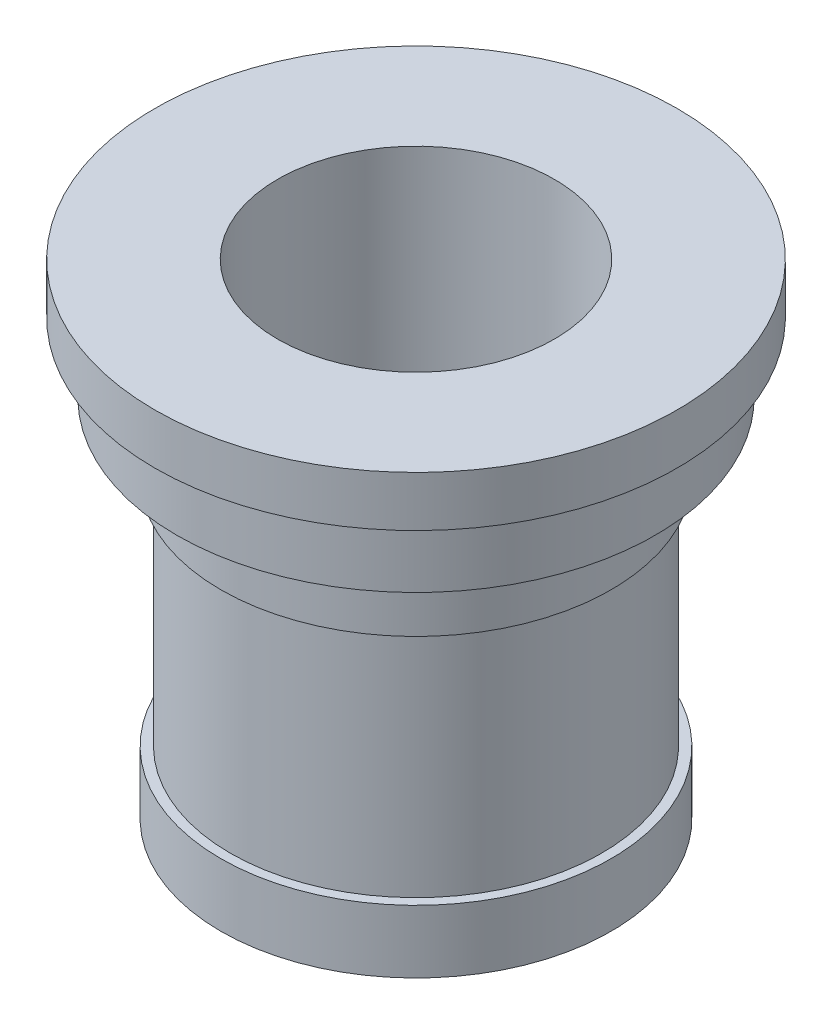
ISO-10303-21;
HEADER;
FILE_DESCRIPTION(('STEP AP214'),'2;1');
FILE_NAME('part.step','',(''),(''),'','','');
FILE_SCHEMA(('AUTOMOTIVE_DESIGN { 1 0 10303 214 1 1 1 1 }'));
ENDSEC;
DATA;
#1=APPLICATION_CONTEXT('core data for automotive mechanical design processes');
#2=APPLICATION_PROTOCOL_DEFINITION('international standard','automotive_design',2000,#1);
#3=PRODUCT_CONTEXT('',#1,'mechanical');
#4=PRODUCT('Part','Part','',(#3));
#5=PRODUCT_RELATED_PRODUCT_CATEGORY('part','',(#4));
#6=PRODUCT_DEFINITION_FORMATION('','',#4);
#7=PRODUCT_DEFINITION_CONTEXT('part definition',#1,'design');
#8=PRODUCT_DEFINITION('design','',#6,#7);
#9=PRODUCT_DEFINITION_SHAPE('','',#8);
#10=(LENGTH_UNIT() NAMED_UNIT(*) SI_UNIT(.MILLI.,.METRE.));
#11=(NAMED_UNIT(*) PLANE_ANGLE_UNIT() SI_UNIT($,.RADIAN.));
#12=(NAMED_UNIT(*) SI_UNIT($,.STERADIAN.) SOLID_ANGLE_UNIT());
#13=UNCERTAINTY_MEASURE_WITH_UNIT(LENGTH_MEASURE(1.E-05),#10,'distance_accuracy_value','');
#14=(GEOMETRIC_REPRESENTATION_CONTEXT(3) GLOBAL_UNCERTAINTY_ASSIGNED_CONTEXT((#13)) GLOBAL_UNIT_ASSIGNED_CONTEXT((#10,
#11,#12)) REPRESENTATION_CONTEXT('',''));
#15=CARTESIAN_POINT('',(0.,0.,0.));
#16=DIRECTION('',(0.,0.,1.));
#17=DIRECTION('',(1.,0.,0.));
#18=AXIS2_PLACEMENT_3D('',#15,#16,#17);
#19=CARTESIAN_POINT('',(31.,0.,0.));
#20=DIRECTION('',(0.,1.,0.));
#21=DIRECTION('',(0.,0.,1.));
#22=AXIS2_PLACEMENT_3D('',#19,#20,#21);
#23=PLANE('',#22);
#24=CARTESIAN_POINT('',(0.,0.,0.));
#25=DIRECTION('',(0.,1.,0.));
#26=DIRECTION('',(0.,0.,1.));
#27=AXIS2_PLACEMENT_3D('',#24,#25,#26);
#28=CIRCLE('',#27,31.);
#29=CARTESIAN_POINT('',(0.,0.,31.));
#30=VERTEX_POINT('',#29);
#31=EDGE_CURVE('E102',#30,#30,#28,.T.);
#32=ORIENTED_EDGE('',*,*,#31,.F.);
#33=EDGE_LOOP('',(#32));
#34=FACE_BOUND('',#33,.T.);
#35=CARTESIAN_POINT('',(0.,0.,0.));
#36=DIRECTION('',(0.,1.,0.));
#37=DIRECTION('',(0.,0.,1.));
#38=AXIS2_PLACEMENT_3D('',#35,#36,#37);
#39=CIRCLE('',#38,22.);
#40=CARTESIAN_POINT('',(-21.9488636363636,0.,1.49912810403716));
#41=VERTEX_POINT('',#40);
#42=CARTESIAN_POINT('',(-21.9488636363636,0.,-1.49912810403716));
#43=VERTEX_POINT('',#42);
#44=EDGE_CURVE('E68',#41,#43,#39,.T.);
#45=ORIENTED_EDGE('',*,*,#44,.T.);
#46=CARTESIAN_POINT('',(-22.,0.,0.));
#47=DIRECTION('',(0.,-1.,0.));
#48=DIRECTION('',(0.,0.,-1.));
#49=AXIS2_PLACEMENT_3D('',#46,#47,#48);
#50=CIRCLE('',#49,1.5);
#51=EDGE_CURVE('E58',#41,#43,#50,.T.);
#52=ORIENTED_EDGE('',*,*,#51,.F.);
#53=EDGE_LOOP('',(#45,#52));
#54=FACE_BOUND('',#53,.T.);
#55=ADVANCED_FACE('F33',(#34,#54),#23,.F.);
#56=CARTESIAN_POINT('',(0.,42.013888888889,0.));
#57=DIRECTION('',(0.,1.,0.));
#58=DIRECTION('',(0.,0.,1.));
#59=AXIS2_PLACEMENT_3D('',#56,#57,#58);
#60=CYLINDRICAL_SURFACE('',#59,22.);
#61=ORIENTED_EDGE('',*,*,#44,.F.);
#62=DIRECTION('',(0.,-1.,0.));
#63=VECTOR('',#62,1.);
#64=CARTESIAN_POINT('',(-21.9488636363636,2.5,1.49912810403716));
#65=LINE('',#64,#63);
#66=CARTESIAN_POINT('',(-21.9488636363636,5.,1.49912810403716));
#67=VERTEX_POINT('',#66);
#68=EDGE_CURVE('E11',#41,#67,#65,.F.);
#69=ORIENTED_EDGE('',*,*,#68,.T.);
#70=CARTESIAN_POINT('',(0.,5.,0.));
#71=DIRECTION('',(0.,-1.,0.));
#72=DIRECTION('',(0.,0.,-1.));
#73=AXIS2_PLACEMENT_3D('',#70,#71,#72);
#74=CIRCLE('',#73,22.);
#75=CARTESIAN_POINT('',(-21.9488636363636,5.,-1.49912810403716));
#76=VERTEX_POINT('',#75);
#77=EDGE_CURVE('E50',#76,#67,#74,.F.);
#78=ORIENTED_EDGE('',*,*,#77,.F.);
#79=DIRECTION('',(0.,-1.,0.));
#80=VECTOR('',#79,1.);
#81=CARTESIAN_POINT('',(-21.9488636363636,2.5,-1.49912810403716));
#82=LINE('',#81,#80);
#83=EDGE_CURVE('E40',#76,#43,#82,.T.);
#84=ORIENTED_EDGE('',*,*,#83,.T.);
#85=EDGE_LOOP('',(#61,#69,#78,#84));
#86=FACE_BOUND('',#85,.T.);
#87=CARTESIAN_POINT('',(0.,77.,0.));
#88=DIRECTION('',(0.,1.,0.));
#89=DIRECTION('',(0.,0.,1.));
#90=AXIS2_PLACEMENT_3D('',#87,#88,#89);
#91=CIRCLE('',#90,22.);
#92=CARTESIAN_POINT('',(0.,77.,22.));
#93=VERTEX_POINT('',#92);
#94=EDGE_CURVE('E69',#93,#93,#91,.T.);
#95=ORIENTED_EDGE('',*,*,#94,.T.);
#96=EDGE_LOOP('',(#95));
#97=FACE_BOUND('',#96,.T.);
#98=ADVANCED_FACE('F66',(#86,#97),#60,.F.);
#99=CARTESIAN_POINT('',(22.,77.,0.));
#100=DIRECTION('',(0.,-1.,0.));
#101=DIRECTION('',(0.,0.,-1.));
#102=AXIS2_PLACEMENT_3D('',#99,#100,#101);
#103=PLANE('',#102);
#104=ORIENTED_EDGE('',*,*,#94,.F.);
#105=EDGE_LOOP('',(#104));
#106=FACE_BOUND('',#105,.T.);
#107=CARTESIAN_POINT('',(0.,77.,0.));
#108=DIRECTION('',(0.,1.,0.));
#109=DIRECTION('',(0.,0.,1.));
#110=AXIS2_PLACEMENT_3D('',#107,#108,#109);
#111=CIRCLE('',#110,41.5);
#112=CARTESIAN_POINT('',(0.,77.,41.5));
#113=VERTEX_POINT('',#112);
#114=EDGE_CURVE('E73',#113,#113,#111,.T.);
#115=ORIENTED_EDGE('',*,*,#114,.T.);
#116=EDGE_LOOP('',(#115));
#117=FACE_BOUND('',#116,.T.);
#118=ADVANCED_FACE('F113',(#106,#117),#103,.F.);
#119=CARTESIAN_POINT('',(0.,42.013888888889,0.));
#120=DIRECTION('',(0.,1.,0.));
#121=DIRECTION('',(0.,0.,1.));
#122=AXIS2_PLACEMENT_3D('',#119,#120,#121);
#123=CYLINDRICAL_SURFACE('',#122,41.5);
#124=ORIENTED_EDGE('',*,*,#114,.F.);
#125=EDGE_LOOP('',(#124));
#126=FACE_BOUND('',#125,.T.);
#127=CARTESIAN_POINT('',(0.,69.,0.));
#128=DIRECTION('',(0.,1.,0.));
#129=DIRECTION('',(0.,0.,1.));
#130=AXIS2_PLACEMENT_3D('',#127,#128,#129);
#131=CIRCLE('',#130,41.5);
#132=CARTESIAN_POINT('',(0.,69.,41.5));
#133=VERTEX_POINT('',#132);
#134=EDGE_CURVE('E78',#133,#133,#131,.T.);
#135=ORIENTED_EDGE('',*,*,#134,.T.);
#136=EDGE_LOOP('',(#135));
#137=FACE_BOUND('',#136,.T.);
#138=ADVANCED_FACE('F117',(#126,#137),#123,.T.);
#139=CARTESIAN_POINT('',(41.5,69.,0.));
#140=DIRECTION('',(0.,1.,0.));
#141=DIRECTION('',(0.,0.,1.));
#142=AXIS2_PLACEMENT_3D('',#139,#140,#141);
#143=PLANE('',#142);
#144=ORIENTED_EDGE('',*,*,#134,.F.);
#145=EDGE_LOOP('',(#144));
#146=FACE_BOUND('',#145,.T.);
#147=CARTESIAN_POINT('',(0.,69.,0.));
#148=DIRECTION('',(0.,1.,0.));
#149=DIRECTION('',(0.,0.,1.));
#150=AXIS2_PLACEMENT_3D('',#147,#148,#149);
#151=CIRCLE('',#150,38.);
#152=CARTESIAN_POINT('',(0.,69.,38.));
#153=VERTEX_POINT('',#152);
#154=EDGE_CURVE('E81',#153,#153,#151,.T.);
#155=ORIENTED_EDGE('',*,*,#154,.T.);
#156=EDGE_LOOP('',(#155));
#157=FACE_BOUND('',#156,.T.);
#158=ADVANCED_FACE('F123',(#146,#157),#143,.F.);
#159=CARTESIAN_POINT('',(0.,42.013888888889,0.));
#160=DIRECTION('',(0.,1.,0.));
#161=DIRECTION('',(0.,0.,1.));
#162=AXIS2_PLACEMENT_3D('',#159,#160,#161);
#163=CYLINDRICAL_SURFACE('',#162,38.);
#164=ORIENTED_EDGE('',*,*,#154,.F.);
#165=EDGE_LOOP('',(#164));
#166=FACE_BOUND('',#165,.T.);
#167=CARTESIAN_POINT('',(0.,58.,0.));
#168=DIRECTION('',(0.,1.,0.));
#169=DIRECTION('',(0.,0.,1.));
#170=AXIS2_PLACEMENT_3D('',#167,#168,#169);
#171=CIRCLE('',#170,38.);
#172=CARTESIAN_POINT('',(0.,58.,38.));
#173=VERTEX_POINT('',#172);
#174=EDGE_CURVE('E84',#173,#173,#171,.T.);
#175=ORIENTED_EDGE('',*,*,#174,.T.);
#176=EDGE_LOOP('',(#175));
#177=FACE_BOUND('',#176,.T.);
#178=ADVANCED_FACE('F127',(#166,#177),#163,.T.);
#179=CARTESIAN_POINT('',(38.,58.,0.));
#180=DIRECTION('',(0.,1.,0.));
#181=DIRECTION('',(0.,0.,1.));
#182=AXIS2_PLACEMENT_3D('',#179,#180,#181);
#183=PLANE('',#182);
#184=ORIENTED_EDGE('',*,*,#174,.F.);
#185=EDGE_LOOP('',(#184));
#186=FACE_BOUND('',#185,.T.);
#187=CARTESIAN_POINT('',(0.,58.,0.));
#188=DIRECTION('',(0.,1.,0.));
#189=DIRECTION('',(0.,0.,1.));
#190=AXIS2_PLACEMENT_3D('',#187,#188,#189);
#191=CIRCLE('',#190,31.);
#192=CARTESIAN_POINT('',(0.,58.,31.));
#193=VERTEX_POINT('',#192);
#194=EDGE_CURVE('E87',#193,#193,#191,.T.);
#195=ORIENTED_EDGE('',*,*,#194,.T.);
#196=EDGE_LOOP('',(#195));
#197=FACE_BOUND('',#196,.T.);
#198=ADVANCED_FACE('F131',(#186,#197),#183,.F.);
#199=CARTESIAN_POINT('',(0.,42.013888888889,0.));
#200=DIRECTION('',(0.,1.,0.));
#201=DIRECTION('',(0.,0.,1.));
#202=AXIS2_PLACEMENT_3D('',#199,#200,#201);
#203=CYLINDRICAL_SURFACE('',#202,31.);
#204=ORIENTED_EDGE('',*,*,#194,.F.);
#205=EDGE_LOOP('',(#204));
#206=FACE_BOUND('',#205,.T.);
#207=CARTESIAN_POINT('',(0.,47.,0.));
#208=DIRECTION('',(0.,1.,0.));
#209=DIRECTION('',(0.,0.,1.));
#210=AXIS2_PLACEMENT_3D('',#207,#208,#209);
#211=CIRCLE('',#210,31.);
#212=CARTESIAN_POINT('',(0.,47.,31.));
#213=VERTEX_POINT('',#212);
#214=EDGE_CURVE('E90',#213,#213,#211,.T.);
#215=ORIENTED_EDGE('',*,*,#214,.T.);
#216=EDGE_LOOP('',(#215));
#217=FACE_BOUND('',#216,.T.);
#218=ADVANCED_FACE('F135',(#206,#217),#203,.T.);
#219=CARTESIAN_POINT('',(31.,47.,0.));
#220=DIRECTION('',(0.,1.,0.));
#221=DIRECTION('',(0.,0.,1.));
#222=AXIS2_PLACEMENT_3D('',#219,#220,#221);
#223=PLANE('',#222);
#224=ORIENTED_EDGE('',*,*,#214,.F.);
#225=EDGE_LOOP('',(#224));
#226=FACE_BOUND('',#225,.T.);
#227=CARTESIAN_POINT('',(0.,47.,0.));
#228=DIRECTION('',(0.,1.,0.));
#229=DIRECTION('',(0.,0.,1.));
#230=AXIS2_PLACEMENT_3D('',#227,#228,#229);
#231=CIRCLE('',#230,29.5);
#232=CARTESIAN_POINT('',(0.,47.,29.5));
#233=VERTEX_POINT('',#232);
#234=EDGE_CURVE('E93',#233,#233,#231,.T.);
#235=ORIENTED_EDGE('',*,*,#234,.T.);
#236=EDGE_LOOP('',(#235));
#237=FACE_BOUND('',#236,.T.);
#238=ADVANCED_FACE('F139',(#226,#237),#223,.F.);
#239=CARTESIAN_POINT('',(0.,42.013888888889,0.));
#240=DIRECTION('',(0.,1.,0.));
#241=DIRECTION('',(0.,0.,1.));
#242=AXIS2_PLACEMENT_3D('',#239,#240,#241);
#243=CYLINDRICAL_SURFACE('',#242,29.5);
#244=ORIENTED_EDGE('',*,*,#234,.F.);
#245=EDGE_LOOP('',(#244));
#246=FACE_BOUND('',#245,.T.);
#247=CARTESIAN_POINT('',(0.,10.,0.));
#248=DIRECTION('',(0.,1.,0.));
#249=DIRECTION('',(0.,0.,1.));
#250=AXIS2_PLACEMENT_3D('',#247,#248,#249);
#251=CIRCLE('',#250,29.5);
#252=CARTESIAN_POINT('',(0.,10.,29.5));
#253=VERTEX_POINT('',#252);
#254=EDGE_CURVE('E96',#253,#253,#251,.T.);
#255=ORIENTED_EDGE('',*,*,#254,.T.);
#256=EDGE_LOOP('',(#255));
#257=FACE_BOUND('',#256,.T.);
#258=ADVANCED_FACE('F143',(#246,#257),#243,.T.);
#259=CARTESIAN_POINT('',(29.5,10.,0.));
#260=DIRECTION('',(0.,-1.,0.));
#261=DIRECTION('',(0.,0.,-1.));
#262=AXIS2_PLACEMENT_3D('',#259,#260,#261);
#263=PLANE('',#262);
#264=ORIENTED_EDGE('',*,*,#254,.F.);
#265=EDGE_LOOP('',(#264));
#266=FACE_BOUND('',#265,.T.);
#267=CARTESIAN_POINT('',(0.,10.,0.));
#268=DIRECTION('',(0.,1.,0.));
#269=DIRECTION('',(0.,0.,1.));
#270=AXIS2_PLACEMENT_3D('',#267,#268,#269);
#271=CIRCLE('',#270,31.);
#272=CARTESIAN_POINT('',(0.,10.,31.));
#273=VERTEX_POINT('',#272);
#274=EDGE_CURVE('E99',#273,#273,#271,.T.);
#275=ORIENTED_EDGE('',*,*,#274,.T.);
#276=EDGE_LOOP('',(#275));
#277=FACE_BOUND('',#276,.T.);
#278=ADVANCED_FACE('F147',(#266,#277),#263,.F.);
#279=CARTESIAN_POINT('',(0.,42.013888888889,0.));
#280=DIRECTION('',(0.,1.,0.));
#281=DIRECTION('',(0.,0.,1.));
#282=AXIS2_PLACEMENT_3D('',#279,#280,#281);
#283=CYLINDRICAL_SURFACE('',#282,31.);
#284=ORIENTED_EDGE('',*,*,#274,.F.);
#285=EDGE_LOOP('',(#284));
#286=FACE_BOUND('',#285,.T.);
#287=ORIENTED_EDGE('',*,*,#31,.T.);
#288=EDGE_LOOP('',(#287));
#289=FACE_BOUND('',#288,.T.);
#290=ADVANCED_FACE('F107',(#286,#289),#283,.T.);
#291=CARTESIAN_POINT('',(-22.,5.,0.));
#292=DIRECTION('',(0.,-1.,0.));
#293=DIRECTION('',(0.,0.,-1.));
#294=AXIS2_PLACEMENT_3D('',#291,#292,#293);
#295=CYLINDRICAL_SURFACE('',#294,1.5);
#296=ORIENTED_EDGE('',*,*,#51,.T.);
#297=ORIENTED_EDGE('',*,*,#83,.F.);
#298=CARTESIAN_POINT('',(-22.,5.,0.));
#299=DIRECTION('',(0.,-1.,0.));
#300=DIRECTION('',(0.,0.,-1.));
#301=AXIS2_PLACEMENT_3D('',#298,#299,#300);
#302=CIRCLE('',#301,1.5);
#303=EDGE_CURVE('E46',#67,#76,#302,.T.);
#304=ORIENTED_EDGE('',*,*,#303,.F.);
#305=ORIENTED_EDGE('',*,*,#68,.F.);
#306=EDGE_LOOP('',(#296,#297,#304,#305));
#307=FACE_BOUND('',#306,.T.);
#308=ADVANCED_FACE('F60',(#307),#295,.F.);
#309=CARTESIAN_POINT('',(-22.,5.,0.));
#310=DIRECTION('',(0.,-1.,0.));
#311=DIRECTION('',(0.,0.,-1.));
#312=AXIS2_PLACEMENT_3D('',#309,#310,#311);
#313=PLANE('',#312);
#314=ORIENTED_EDGE('',*,*,#77,.T.);
#315=ORIENTED_EDGE('',*,*,#303,.T.);
#316=EDGE_LOOP('',(#314,#315));
#317=FACE_BOUND('',#316,.T.);
#318=ADVANCED_FACE('F157',(#317),#313,.T.);
#319=CLOSED_SHELL('',(#55,#98,#118,#138,#158,#178,#198,#218,#238,#258,#278,#290,#308,#318));
#320=MANIFOLD_SOLID_BREP('B2',#319);
#321=ADVANCED_BREP_SHAPE_REPRESENTATION('',(#18,#320),#14);
#322=SHAPE_DEFINITION_REPRESENTATION(#9,#321);
ENDSEC;
END-ISO-10303-21;
